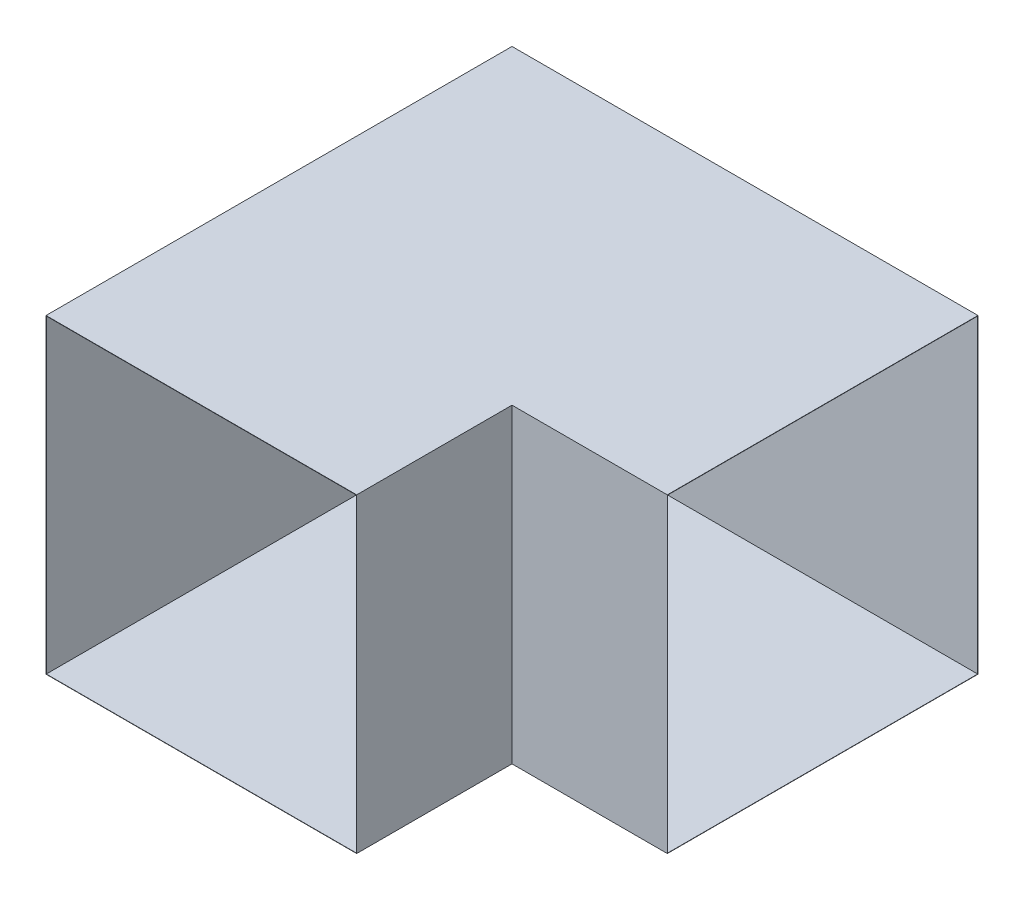
ISO-10303-21;
HEADER;
FILE_DESCRIPTION(('STEP AP214'),'2;1');
FILE_NAME('part.step','',(''),(''),'','','');
FILE_SCHEMA(('AUTOMOTIVE_DESIGN { 1 0 10303 214 1 1 1 1 }'));
ENDSEC;
DATA;
#1=APPLICATION_CONTEXT('core data for automotive mechanical design processes');
#2=APPLICATION_PROTOCOL_DEFINITION('international standard','automotive_design',2000,#1);
#3=PRODUCT_CONTEXT('',#1,'mechanical');
#4=PRODUCT('Part','Part','',(#3));
#5=PRODUCT_RELATED_PRODUCT_CATEGORY('part','',(#4));
#6=PRODUCT_DEFINITION_FORMATION('','',#4);
#7=PRODUCT_DEFINITION_CONTEXT('part definition',#1,'design');
#8=PRODUCT_DEFINITION('design','',#6,#7);
#9=PRODUCT_DEFINITION_SHAPE('','',#8);
#10=(LENGTH_UNIT() NAMED_UNIT(*) SI_UNIT(.MILLI.,.METRE.));
#11=(NAMED_UNIT(*) PLANE_ANGLE_UNIT() SI_UNIT($,.RADIAN.));
#12=(NAMED_UNIT(*) SI_UNIT($,.STERADIAN.) SOLID_ANGLE_UNIT());
#13=UNCERTAINTY_MEASURE_WITH_UNIT(LENGTH_MEASURE(1.E-05),#10,'distance_accuracy_value','');
#14=(GEOMETRIC_REPRESENTATION_CONTEXT(3) GLOBAL_UNCERTAINTY_ASSIGNED_CONTEXT((#13)) GLOBAL_UNIT_ASSIGNED_CONTEXT((#10,
#11,#12)) REPRESENTATION_CONTEXT('',''));
#15=CARTESIAN_POINT('',(0.,0.,0.));
#16=DIRECTION('',(0.,0.,1.));
#17=DIRECTION('',(1.,0.,0.));
#18=AXIS2_PLACEMENT_3D('',#15,#16,#17);
#19=CARTESIAN_POINT('',(998.,-1000.,-500000.));
#20=DIRECTION('',(1.,0.,0.));
#21=DIRECTION('',(0.,0.,-1.));
#22=AXIS2_PLACEMENT_3D('',#19,#20,#21);
#23=PLANE('',#22);
#24=DIRECTION('',(0.,0.,1.));
#25=VECTOR('',#24,1.);
#26=CARTESIAN_POINT('',(998.,998.,-500000.));
#27=LINE('',#26,#25);
#28=CARTESIAN_POINT('',(998.,998.,998.000000000047));
#29=VERTEX_POINT('',#28);
#30=CARTESIAN_POINT('',(998.,998.,2000.00000000001));
#31=VERTEX_POINT('',#30);
#32=EDGE_CURVE('E212',#29,#31,#27,.T.);
#33=ORIENTED_EDGE('',*,*,#32,.F.);
#34=DIRECTION('',(0.,1.,0.));
#35=VECTOR('',#34,1.);
#36=CARTESIAN_POINT('',(998.,998.000000000008,998.000000000021));
#37=LINE('',#36,#35);
#38=CARTESIAN_POINT('',(998.,-997.999999999993,998.000000000007));
#39=VERTEX_POINT('',#38);
#40=EDGE_CURVE('E198',#39,#29,#37,.T.);
#41=ORIENTED_EDGE('',*,*,#40,.F.);
#42=DIRECTION('',(0.,0.,1.));
#43=VECTOR('',#42,1.);
#44=CARTESIAN_POINT('',(998.,-998.,-500000.));
#45=LINE('',#44,#43);
#46=CARTESIAN_POINT('',(998.,-998.,2000.00000000001));
#47=VERTEX_POINT('',#46);
#48=EDGE_CURVE('E210',#39,#47,#45,.T.);
#49=ORIENTED_EDGE('',*,*,#48,.T.);
#50=DIRECTION('',(0.,1.,0.));
#51=VECTOR('',#50,1.);
#52=CARTESIAN_POINT('',(998.,-1000.,2000.00000000001));
#53=LINE('',#52,#51);
#54=EDGE_CURVE('E213',#47,#31,#53,.T.);
#55=ORIENTED_EDGE('',*,*,#54,.T.);
#56=EDGE_LOOP('',(#33,#41,#49,#55));
#57=FACE_BOUND('',#56,.T.);
#58=ADVANCED_FACE('F107',(#57),#23,.F.);
#59=CARTESIAN_POINT('',(-998.,-1000.,-500000.));
#60=DIRECTION('',(-1.,0.,0.));
#61=DIRECTION('',(0.,-1.,0.));
#62=AXIS2_PLACEMENT_3D('',#59,#60,#61);
#63=PLANE('',#62);
#64=DIRECTION('',(0.,0.,1.));
#65=VECTOR('',#64,1.);
#66=CARTESIAN_POINT('',(-998.,-998.,-500000.));
#67=LINE('',#66,#65);
#68=CARTESIAN_POINT('',(-998.,-997.999999999979,-997.999999999992));
#69=VERTEX_POINT('',#68);
#70=CARTESIAN_POINT('',(-998.,-998.,2000.00000000001));
#71=VERTEX_POINT('',#70);
#72=EDGE_CURVE('E219',#69,#71,#67,.T.);
#73=ORIENTED_EDGE('',*,*,#72,.F.);
#74=DIRECTION('',(0.,1.,0.));
#75=VECTOR('',#74,1.);
#76=CARTESIAN_POINT('',(-998.,1000.00000000002,-997.999999999979));
#77=LINE('',#76,#75);
#78=CARTESIAN_POINT('',(-998.,998.000000000021,-997.999999999979));
#79=VERTEX_POINT('',#78);
#80=EDGE_CURVE('E230',#69,#79,#77,.T.);
#81=ORIENTED_EDGE('',*,*,#80,.T.);
#82=DIRECTION('',(0.,0.,1.));
#83=VECTOR('',#82,1.);
#84=CARTESIAN_POINT('',(-998.,998.,-500000.));
#85=LINE('',#84,#83);
#86=CARTESIAN_POINT('',(-998.,998.,2000.00000000001));
#87=VERTEX_POINT('',#86);
#88=EDGE_CURVE('E222',#79,#87,#85,.T.);
#89=ORIENTED_EDGE('',*,*,#88,.T.);
#90=DIRECTION('',(0.,-1.,0.));
#91=VECTOR('',#90,1.);
#92=CARTESIAN_POINT('',(-998.,-1000.,2000.00000000001));
#93=LINE('',#92,#91);
#94=EDGE_CURVE('E306',#87,#71,#93,.T.);
#95=ORIENTED_EDGE('',*,*,#94,.T.);
#96=EDGE_LOOP('',(#73,#81,#89,#95));
#97=FACE_BOUND('',#96,.T.);
#98=ADVANCED_FACE('F325',(#97),#63,.F.);
#99=CARTESIAN_POINT('',(-1000.,1000.00000000002,-999.999999999979));
#100=DIRECTION('',(0.,1.,0.));
#101=DIRECTION('',(0.,0.,1.));
#102=AXIS2_PLACEMENT_3D('',#99,#100,#101);
#103=PLANE('',#102);
#104=DIRECTION('',(0.,0.,1.));
#105=VECTOR('',#104,1.);
#106=CARTESIAN_POINT('',(2000.,1000.00000000002,-999.999999999979));
#107=LINE('',#106,#105);
#108=CARTESIAN_POINT('',(2000.,1000.00000000002,-999.999999999979));
#109=VERTEX_POINT('',#108);
#110=CARTESIAN_POINT('',(2000.,1000.00000000001,1000.00000000002));
#111=VERTEX_POINT('',#110);
#112=EDGE_CURVE('E243',#109,#111,#107,.T.);
#113=ORIENTED_EDGE('',*,*,#112,.F.);
#114=DIRECTION('',(1.,0.,0.));
#115=VECTOR('',#114,1.);
#116=CARTESIAN_POINT('',(-1000.,1000.00000000002,-999.999999999979));
#117=LINE('',#116,#115);
#118=CARTESIAN_POINT('',(-1000.,1000.00000000002,-999.999999999979));
#119=VERTEX_POINT('',#118);
#120=EDGE_CURVE('E12',#119,#109,#117,.T.);
#121=ORIENTED_EDGE('',*,*,#120,.F.);
#122=DIRECTION('',(0.,0.,1.));
#123=VECTOR('',#122,1.);
#124=CARTESIAN_POINT('',(-1000.,1000.00000000002,-999.999999999979));
#125=LINE('',#124,#123);
#126=CARTESIAN_POINT('',(-1000.,1000.,2000.00000000001));
#127=VERTEX_POINT('',#126);
#128=EDGE_CURVE('E257',#119,#127,#125,.T.);
#129=ORIENTED_EDGE('',*,*,#128,.T.);
#130=DIRECTION('',(-1.,0.,0.));
#131=VECTOR('',#130,1.);
#132=CARTESIAN_POINT('',(1000.,1000.,2000.00000000001));
#133=LINE('',#132,#131);
#134=CARTESIAN_POINT('',(1000.,1000.,2000.00000000001));
#135=VERTEX_POINT('',#134);
#136=EDGE_CURVE('E293',#135,#127,#133,.T.);
#137=ORIENTED_EDGE('',*,*,#136,.F.);
#138=DIRECTION('',(0.,0.,1.));
#139=VECTOR('',#138,1.);
#140=CARTESIAN_POINT('',(1000.,1000.,-500000.));
#141=LINE('',#140,#139);
#142=CARTESIAN_POINT('',(1000.,1000.00000000001,1000.00000000002));
#143=VERTEX_POINT('',#142);
#144=EDGE_CURVE('E224',#143,#135,#141,.T.);
#145=ORIENTED_EDGE('',*,*,#144,.F.);
#146=DIRECTION('',(1.,0.,0.));
#147=VECTOR('',#146,1.);
#148=CARTESIAN_POINT('',(-1000.,1000.00000000001,1000.00000000002));
#149=LINE('',#148,#147);
#150=EDGE_CURVE('E111',#143,#111,#149,.T.);
#151=ORIENTED_EDGE('',*,*,#150,.T.);
#152=EDGE_LOOP('',(#113,#121,#129,#137,#145,#151));
#153=FACE_BOUND('',#152,.T.);
#154=ADVANCED_FACE('F109',(#153),#103,.T.);
#155=CARTESIAN_POINT('',(-1000.,1000.00000000002,-999.999999999979));
#156=DIRECTION('',(0.,0.,-1.));
#157=DIRECTION('',(0.,1.,0.));
#158=AXIS2_PLACEMENT_3D('',#155,#156,#157);
#159=PLANE('',#158);
#160=DIRECTION('',(0.,1.,0.));
#161=VECTOR('',#160,1.);
#162=CARTESIAN_POINT('',(2000.,1000.00000000002,-999.999999999979));
#163=LINE('',#162,#161);
#164=CARTESIAN_POINT('',(2000.,-999.999999999979,-999.999999999992));
#165=VERTEX_POINT('',#164);
#166=EDGE_CURVE('E252',#165,#109,#163,.T.);
#167=ORIENTED_EDGE('',*,*,#166,.F.);
#168=DIRECTION('',(1.,0.,0.));
#169=VECTOR('',#168,1.);
#170=CARTESIAN_POINT('',(-1000.,-999.999999999979,-999.999999999992));
#171=LINE('',#170,#169);
#172=CARTESIAN_POINT('',(-1000.,-999.999999999979,-999.999999999992));
#173=VERTEX_POINT('',#172);
#174=EDGE_CURVE('E116',#173,#165,#171,.T.);
#175=ORIENTED_EDGE('',*,*,#174,.F.);
#176=DIRECTION('',(0.,1.,0.));
#177=VECTOR('',#176,1.);
#178=CARTESIAN_POINT('',(-1000.,1000.00000000002,-999.999999999979));
#179=LINE('',#178,#177);
#180=EDGE_CURVE('E264',#173,#119,#179,.T.);
#181=ORIENTED_EDGE('',*,*,#180,.T.);
#182=ORIENTED_EDGE('',*,*,#120,.T.);
#183=EDGE_LOOP('',(#167,#175,#181,#182));
#184=FACE_BOUND('',#183,.T.);
#185=ADVANCED_FACE('F280',(#184),#159,.T.);
#186=CARTESIAN_POINT('',(-1000.,-999.999999999979,-999.999999999992));
#187=DIRECTION('',(0.,-1.,0.));
#188=DIRECTION('',(0.,0.,-1.));
#189=AXIS2_PLACEMENT_3D('',#186,#187,#188);
#190=PLANE('',#189);
#191=DIRECTION('',(1.,0.,0.));
#192=VECTOR('',#191,1.);
#193=CARTESIAN_POINT('',(-1000.,-999.999999999993,1000.00000000001));
#194=LINE('',#193,#192);
#195=CARTESIAN_POINT('',(1000.,-999.999999999993,1000.00000000001));
#196=VERTEX_POINT('',#195);
#197=CARTESIAN_POINT('',(2000.,-999.999999999993,1000.00000000001));
#198=VERTEX_POINT('',#197);
#199=EDGE_CURVE('E267',#196,#198,#194,.T.);
#200=ORIENTED_EDGE('',*,*,#199,.F.);
#201=DIRECTION('',(0.,0.,1.));
#202=VECTOR('',#201,1.);
#203=CARTESIAN_POINT('',(1000.,-1000.,-500000.));
#204=LINE('',#203,#202);
#205=CARTESIAN_POINT('',(1000.,-1000.,2000.00000000001));
#206=VERTEX_POINT('',#205);
#207=EDGE_CURVE('E220',#196,#206,#204,.T.);
#208=ORIENTED_EDGE('',*,*,#207,.T.);
#209=DIRECTION('',(1.,0.,0.));
#210=VECTOR('',#209,1.);
#211=CARTESIAN_POINT('',(1000.,-1000.,2000.00000000001));
#212=LINE('',#211,#210);
#213=CARTESIAN_POINT('',(-1000.,-1000.,2000.00000000001));
#214=VERTEX_POINT('',#213);
#215=EDGE_CURVE('E292',#214,#206,#212,.T.);
#216=ORIENTED_EDGE('',*,*,#215,.F.);
#217=DIRECTION('',(0.,0.,-1.));
#218=VECTOR('',#217,1.);
#219=CARTESIAN_POINT('',(-1000.,-999.999999999979,-999.999999999992));
#220=LINE('',#219,#218);
#221=EDGE_CURVE('E261',#214,#173,#220,.T.);
#222=ORIENTED_EDGE('',*,*,#221,.T.);
#223=ORIENTED_EDGE('',*,*,#174,.T.);
#224=DIRECTION('',(0.,0.,-1.));
#225=VECTOR('',#224,1.);
#226=CARTESIAN_POINT('',(2000.,-999.999999999979,-999.999999999992));
#227=LINE('',#226,#225);
#228=EDGE_CURVE('E249',#198,#165,#227,.T.);
#229=ORIENTED_EDGE('',*,*,#228,.F.);
#230=EDGE_LOOP('',(#200,#208,#216,#222,#223,#229));
#231=FACE_BOUND('',#230,.T.);
#232=ADVANCED_FACE('F370',(#231),#190,.T.);
#233=CARTESIAN_POINT('',(-1000.,1000.00000000001,1000.00000000002));
#234=DIRECTION('',(0.,0.,1.));
#235=DIRECTION('',(0.,-1.,0.));
#236=AXIS2_PLACEMENT_3D('',#233,#234,#235);
#237=PLANE('',#236);
#238=DIRECTION('',(0.,1.,0.));
#239=VECTOR('',#238,1.);
#240=CARTESIAN_POINT('',(1000.,1000.00000000001,1000.00000000002));
#241=LINE('',#240,#239);
#242=EDGE_CURVE('E233',#196,#143,#241,.T.);
#243=ORIENTED_EDGE('',*,*,#242,.F.);
#244=ORIENTED_EDGE('',*,*,#199,.T.);
#245=DIRECTION('',(0.,-1.,0.));
#246=VECTOR('',#245,1.);
#247=CARTESIAN_POINT('',(2000.,1000.00000000001,1000.00000000002));
#248=LINE('',#247,#246);
#249=EDGE_CURVE('E246',#111,#198,#248,.T.);
#250=ORIENTED_EDGE('',*,*,#249,.F.);
#251=ORIENTED_EDGE('',*,*,#150,.F.);
#252=EDGE_LOOP('',(#243,#244,#250,#251));
#253=FACE_BOUND('',#252,.T.);
#254=ADVANCED_FACE('F273',(#253),#237,.T.);
#255=CARTESIAN_POINT('',(-1000.,0.,0.));
#256=DIRECTION('',(1.,0.,0.));
#257=DIRECTION('',(0.,0.,-1.));
#258=AXIS2_PLACEMENT_3D('',#255,#256,#257);
#259=PLANE('',#258);
#260=ORIENTED_EDGE('',*,*,#128,.F.);
#261=ORIENTED_EDGE('',*,*,#180,.F.);
#262=ORIENTED_EDGE('',*,*,#221,.F.);
#263=DIRECTION('',(0.,-1.,0.));
#264=VECTOR('',#263,1.);
#265=CARTESIAN_POINT('',(-1000.,-1000.,2000.00000000001));
#266=LINE('',#265,#264);
#267=EDGE_CURVE('E288',#127,#214,#266,.T.);
#268=ORIENTED_EDGE('',*,*,#267,.F.);
#269=EDGE_LOOP('',(#260,#261,#262,#268));
#270=FACE_BOUND('',#269,.T.);
#271=ADVANCED_FACE('F286',(#270),#259,.F.);
#272=CARTESIAN_POINT('',(-1000.,998.000000000021,-999.999999999979));
#273=DIRECTION('',(0.,1.,0.));
#274=DIRECTION('',(0.,0.,1.));
#275=AXIS2_PLACEMENT_3D('',#272,#273,#274);
#276=PLANE('',#275);
#277=DIRECTION('',(1.,0.,0.));
#278=VECTOR('',#277,1.);
#279=CARTESIAN_POINT('',(-1000.,998.000000000008,998.000000000021));
#280=LINE('',#279,#278);
#281=CARTESIAN_POINT('',(2000.,998.000000000008,998.000000000021));
#282=VERTEX_POINT('',#281);
#283=EDGE_CURVE('E124',#29,#282,#280,.T.);
#284=ORIENTED_EDGE('',*,*,#283,.F.);
#285=ORIENTED_EDGE('',*,*,#32,.T.);
#286=DIRECTION('',(-1.,0.,0.));
#287=VECTOR('',#286,1.);
#288=CARTESIAN_POINT('',(1000.,998.,2000.00000000001));
#289=LINE('',#288,#287);
#290=EDGE_CURVE('E311',#31,#87,#289,.T.);
#291=ORIENTED_EDGE('',*,*,#290,.T.);
#292=ORIENTED_EDGE('',*,*,#88,.F.);
#293=DIRECTION('',(1.,0.,0.));
#294=VECTOR('',#293,1.);
#295=CARTESIAN_POINT('',(-1000.,998.000000000021,-997.999999999979));
#296=LINE('',#295,#294);
#297=CARTESIAN_POINT('',(2000.,998.000000000021,-997.999999999979));
#298=VERTEX_POINT('',#297);
#299=EDGE_CURVE('E255',#79,#298,#296,.T.);
#300=ORIENTED_EDGE('',*,*,#299,.T.);
#301=DIRECTION('',(0.,0.,1.));
#302=VECTOR('',#301,1.);
#303=CARTESIAN_POINT('',(2000.,998.000000000021,-999.999999999979));
#304=LINE('',#303,#302);
#305=EDGE_CURVE('E235',#298,#282,#304,.T.);
#306=ORIENTED_EDGE('',*,*,#305,.T.);
#307=EDGE_LOOP('',(#284,#285,#291,#292,#300,#306));
#308=FACE_BOUND('',#307,.T.);
#309=ADVANCED_FACE('F316',(#308),#276,.F.);
#310=CARTESIAN_POINT('',(-1000.,1000.00000000002,-997.999999999979));
#311=DIRECTION('',(0.,0.,-1.));
#312=DIRECTION('',(0.,1.,0.));
#313=AXIS2_PLACEMENT_3D('',#310,#311,#312);
#314=PLANE('',#313);
#315=DIRECTION('',(0.,1.,0.));
#316=VECTOR('',#315,1.);
#317=CARTESIAN_POINT('',(2000.,1000.00000000002,-997.999999999979));
#318=LINE('',#317,#316);
#319=CARTESIAN_POINT('',(2000.,-997.999999999979,-997.999999999992));
#320=VERTEX_POINT('',#319);
#321=EDGE_CURVE('E240',#320,#298,#318,.T.);
#322=ORIENTED_EDGE('',*,*,#321,.T.);
#323=ORIENTED_EDGE('',*,*,#299,.F.);
#324=ORIENTED_EDGE('',*,*,#80,.F.);
#325=DIRECTION('',(1.,0.,0.));
#326=VECTOR('',#325,1.);
#327=CARTESIAN_POINT('',(-1000.,-997.999999999979,-997.999999999992));
#328=LINE('',#327,#326);
#329=EDGE_CURVE('E206',#69,#320,#328,.T.);
#330=ORIENTED_EDGE('',*,*,#329,.T.);
#331=EDGE_LOOP('',(#322,#323,#324,#330));
#332=FACE_BOUND('',#331,.T.);
#333=ADVANCED_FACE('F320',(#332),#314,.F.);
#334=CARTESIAN_POINT('',(-1000.,-997.999999999979,-999.999999999992));
#335=DIRECTION('',(0.,-1.,0.));
#336=DIRECTION('',(0.,0.,-1.));
#337=AXIS2_PLACEMENT_3D('',#334,#335,#336);
#338=PLANE('',#337);
#339=DIRECTION('',(0.,0.,-1.));
#340=VECTOR('',#339,1.);
#341=CARTESIAN_POINT('',(2000.,-997.999999999979,-999.999999999992));
#342=LINE('',#341,#340);
#343=CARTESIAN_POINT('',(2000.,-997.999999999993,998.000000000007));
#344=VERTEX_POINT('',#343);
#345=EDGE_CURVE('E238',#344,#320,#342,.T.);
#346=ORIENTED_EDGE('',*,*,#345,.T.);
#347=ORIENTED_EDGE('',*,*,#329,.F.);
#348=ORIENTED_EDGE('',*,*,#72,.T.);
#349=DIRECTION('',(1.,0.,0.));
#350=VECTOR('',#349,1.);
#351=CARTESIAN_POINT('',(1000.,-998.,2000.00000000001));
#352=LINE('',#351,#350);
#353=EDGE_CURVE('E217',#71,#47,#352,.T.);
#354=ORIENTED_EDGE('',*,*,#353,.T.);
#355=ORIENTED_EDGE('',*,*,#48,.F.);
#356=DIRECTION('',(1.,0.,0.));
#357=VECTOR('',#356,1.);
#358=CARTESIAN_POINT('',(-1000.,-997.999999999993,998.000000000007));
#359=LINE('',#358,#357);
#360=EDGE_CURVE('E195',#39,#344,#359,.T.);
#361=ORIENTED_EDGE('',*,*,#360,.T.);
#362=EDGE_LOOP('',(#346,#347,#348,#354,#355,#361));
#363=FACE_BOUND('',#362,.T.);
#364=ADVANCED_FACE('F215',(#363),#338,.F.);
#365=CARTESIAN_POINT('',(-1000.,1000.00000000001,998.000000000021));
#366=DIRECTION('',(0.,0.,1.));
#367=DIRECTION('',(0.,-1.,0.));
#368=AXIS2_PLACEMENT_3D('',#365,#366,#367);
#369=PLANE('',#368);
#370=ORIENTED_EDGE('',*,*,#360,.F.);
#371=ORIENTED_EDGE('',*,*,#40,.T.);
#372=ORIENTED_EDGE('',*,*,#283,.T.);
#373=DIRECTION('',(0.,-1.,0.));
#374=VECTOR('',#373,1.);
#375=CARTESIAN_POINT('',(2000.,1000.00000000001,998.000000000021));
#376=LINE('',#375,#374);
#377=EDGE_CURVE('E201',#282,#344,#376,.T.);
#378=ORIENTED_EDGE('',*,*,#377,.T.);
#379=EDGE_LOOP('',(#370,#371,#372,#378));
#380=FACE_BOUND('',#379,.T.);
#381=ADVANCED_FACE('F197',(#380),#369,.F.);
#382=CARTESIAN_POINT('',(2000.,0.,0.));
#383=DIRECTION('',(1.,0.,0.));
#384=DIRECTION('',(0.,0.,-1.));
#385=AXIS2_PLACEMENT_3D('',#382,#383,#384);
#386=PLANE('',#385);
#387=ORIENTED_EDGE('',*,*,#112,.T.);
#388=ORIENTED_EDGE('',*,*,#249,.T.);
#389=ORIENTED_EDGE('',*,*,#228,.T.);
#390=ORIENTED_EDGE('',*,*,#166,.T.);
#391=EDGE_LOOP('',(#387,#388,#389,#390));
#392=FACE_BOUND('',#391,.T.);
#393=ORIENTED_EDGE('',*,*,#377,.F.);
#394=ORIENTED_EDGE('',*,*,#305,.F.);
#395=ORIENTED_EDGE('',*,*,#321,.F.);
#396=ORIENTED_EDGE('',*,*,#345,.F.);
#397=EDGE_LOOP('',(#393,#394,#395,#396));
#398=FACE_BOUND('',#397,.T.);
#399=ADVANCED_FACE('F276',(#392,#398),#386,.T.);
#400=CARTESIAN_POINT('',(1000.,-1000.,-500000.));
#401=DIRECTION('',(1.,0.,0.));
#402=DIRECTION('',(0.,0.,-1.));
#403=AXIS2_PLACEMENT_3D('',#400,#401,#402);
#404=PLANE('',#403);
#405=ORIENTED_EDGE('',*,*,#207,.F.);
#406=ORIENTED_EDGE('',*,*,#242,.T.);
#407=ORIENTED_EDGE('',*,*,#144,.T.);
#408=DIRECTION('',(0.,1.,0.));
#409=VECTOR('',#408,1.);
#410=CARTESIAN_POINT('',(1000.,-1000.,2000.00000000001));
#411=LINE('',#410,#409);
#412=EDGE_CURVE('E296',#206,#135,#411,.T.);
#413=ORIENTED_EDGE('',*,*,#412,.F.);
#414=EDGE_LOOP('',(#405,#406,#407,#413));
#415=FACE_BOUND('',#414,.T.);
#416=ADVANCED_FACE('F302',(#415),#404,.T.);
#417=CARTESIAN_POINT('',(0.,0.,2000.00000000001));
#418=DIRECTION('',(0.,0.,1.));
#419=DIRECTION('',(1.,0.,0.));
#420=AXIS2_PLACEMENT_3D('',#417,#418,#419);
#421=PLANE('',#420);
#422=ORIENTED_EDGE('',*,*,#412,.T.);
#423=ORIENTED_EDGE('',*,*,#136,.T.);
#424=ORIENTED_EDGE('',*,*,#267,.T.);
#425=ORIENTED_EDGE('',*,*,#215,.T.);
#426=EDGE_LOOP('',(#422,#423,#424,#425));
#427=FACE_BOUND('',#426,.T.);
#428=ORIENTED_EDGE('',*,*,#290,.F.);
#429=ORIENTED_EDGE('',*,*,#54,.F.);
#430=ORIENTED_EDGE('',*,*,#353,.F.);
#431=ORIENTED_EDGE('',*,*,#94,.F.);
#432=EDGE_LOOP('',(#428,#429,#430,#431));
#433=FACE_BOUND('',#432,.T.);
#434=ADVANCED_FACE('F304',(#427,#433),#421,.T.);
#435=CLOSED_SHELL('',(#58,#98,#154,#185,#232,#254,#271,#309,#333,#364,#381,#399,#416,#434));
#436=MANIFOLD_SOLID_BREP('B2',#435);
#437=ADVANCED_BREP_SHAPE_REPRESENTATION('',(#18,#436),#14);
#438=SHAPE_DEFINITION_REPRESENTATION(#9,#437);
ENDSEC;
END-ISO-10303-21;
